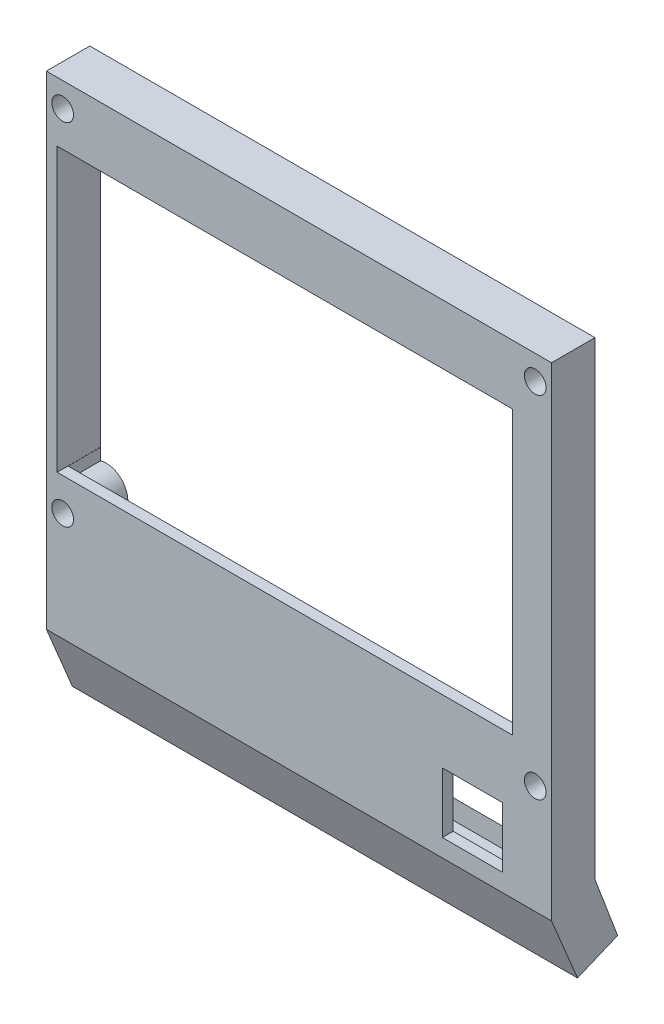
ISO-10303-21;
HEADER;
FILE_DESCRIPTION(('STEP AP214'),'2;1');
FILE_NAME('part.step','',(''),(''),'','','');
FILE_SCHEMA(('AUTOMOTIVE_DESIGN { 1 0 10303 214 1 1 1 1 }'));
ENDSEC;
DATA;
#1=APPLICATION_CONTEXT('core data for automotive mechanical design processes');
#2=APPLICATION_PROTOCOL_DEFINITION('international standard','automotive_design',2000,#1);
#3=PRODUCT_CONTEXT('',#1,'mechanical');
#4=PRODUCT('Part','Part','',(#3));
#5=PRODUCT_RELATED_PRODUCT_CATEGORY('part','',(#4));
#6=PRODUCT_DEFINITION_FORMATION('','',#4);
#7=PRODUCT_DEFINITION_CONTEXT('part definition',#1,'design');
#8=PRODUCT_DEFINITION('design','',#6,#7);
#9=PRODUCT_DEFINITION_SHAPE('','',#8);
#10=(LENGTH_UNIT() NAMED_UNIT(*) SI_UNIT(.MILLI.,.METRE.));
#11=(NAMED_UNIT(*) PLANE_ANGLE_UNIT() SI_UNIT($,.RADIAN.));
#12=(NAMED_UNIT(*) SI_UNIT($,.STERADIAN.) SOLID_ANGLE_UNIT());
#13=UNCERTAINTY_MEASURE_WITH_UNIT(LENGTH_MEASURE(1.E-05),#10,'distance_accuracy_value','');
#14=(GEOMETRIC_REPRESENTATION_CONTEXT(3) GLOBAL_UNCERTAINTY_ASSIGNED_CONTEXT((#13)) GLOBAL_UNIT_ASSIGNED_CONTEXT((#10,
#11,#12)) REPRESENTATION_CONTEXT('',''));
#15=CARTESIAN_POINT('',(0.,0.,0.));
#16=DIRECTION('',(0.,0.,1.));
#17=DIRECTION('',(1.,0.,0.));
#18=AXIS2_PLACEMENT_3D('',#15,#16,#17);
#19=CARTESIAN_POINT('',(39.3212525540889,33.528756997604,0.));
#20=DIRECTION('',(1.,0.,0.));
#21=DIRECTION('',(0.,1.,0.));
#22=AXIS2_PLACEMENT_3D('',#19,#20,#21);
#23=PLANE('',#22);
#24=DIRECTION('',(0.,1.,0.));
#25=VECTOR('',#24,1.);
#26=CARTESIAN_POINT('',(39.3212525540889,33.528756997604,6.));
#27=LINE('',#26,#25);
#28=CARTESIAN_POINT('',(39.3212525540889,-18.471243002396,6.));
#29=VERTEX_POINT('',#28);
#30=CARTESIAN_POINT('',(39.3212525540889,33.528756997604,6.));
#31=VERTEX_POINT('',#30);
#32=EDGE_CURVE('E321',#29,#31,#27,.T.);
#33=ORIENTED_EDGE('',*,*,#32,.F.);
#34=DIRECTION('',(0.,0.,1.));
#35=VECTOR('',#34,1.);
#36=CARTESIAN_POINT('',(39.3212525540889,-18.471243002396,0.));
#37=LINE('',#36,#35);
#38=CARTESIAN_POINT('',(39.3212525540889,-18.471243002396,8.));
#39=VERTEX_POINT('',#38);
#40=EDGE_CURVE('E423',#29,#39,#37,.T.);
#41=ORIENTED_EDGE('',*,*,#40,.T.);
#42=DIRECTION('',(0.,1.,0.));
#43=VECTOR('',#42,1.);
#44=CARTESIAN_POINT('',(39.3212525540889,33.528756997604,8.));
#45=LINE('',#44,#43);
#46=CARTESIAN_POINT('',(39.3212525540889,33.528756997604,8.));
#47=VERTEX_POINT('',#46);
#48=EDGE_CURVE('E414',#39,#47,#45,.T.);
#49=ORIENTED_EDGE('',*,*,#48,.T.);
#50=DIRECTION('',(0.,0.,1.));
#51=VECTOR('',#50,1.);
#52=CARTESIAN_POINT('',(39.3212525540889,33.528756997604,0.));
#53=LINE('',#52,#51);
#54=EDGE_CURVE('E421',#31,#47,#53,.T.);
#55=ORIENTED_EDGE('',*,*,#54,.F.);
#56=EDGE_LOOP('',(#33,#41,#49,#55));
#57=FACE_BOUND('',#56,.T.);
#58=ADVANCED_FACE('F40',(#57),#23,.F.);
#59=CARTESIAN_POINT('',(39.3212525540889,-18.471243002396,0.));
#60=DIRECTION('',(0.,-1.,0.));
#61=DIRECTION('',(1.,0.,0.));
#62=AXIS2_PLACEMENT_3D('',#59,#60,#61);
#63=PLANE('',#62);
#64=DIRECTION('',(0.,0.,1.));
#65=VECTOR('',#64,1.);
#66=CARTESIAN_POINT('',(-44.5,-18.471243002396,0.));
#67=LINE('',#66,#65);
#68=CARTESIAN_POINT('',(-44.5,-18.471243002396,0.));
#69=VERTEX_POINT('',#68);
#70=CARTESIAN_POINT('',(-44.5,-18.471243002396,6.));
#71=VERTEX_POINT('',#70);
#72=EDGE_CURVE('E333',#69,#71,#67,.T.);
#73=ORIENTED_EDGE('',*,*,#72,.F.);
#74=DIRECTION('',(1.,0.,0.));
#75=VECTOR('',#74,1.);
#76=CARTESIAN_POINT('',(39.3212525540889,-18.471243002396,0.));
#77=LINE('',#76,#75);
#78=CARTESIAN_POINT('',(-44.5211222996652,-18.471243002396,0.));
#79=VERTEX_POINT('',#78);
#80=EDGE_CURVE('E403',#79,#69,#77,.T.);
#81=ORIENTED_EDGE('',*,*,#80,.F.);
#82=DIRECTION('',(0.,0.,1.));
#83=VECTOR('',#82,1.);
#84=CARTESIAN_POINT('',(-44.5211222996652,-18.471243002396,0.));
#85=LINE('',#84,#83);
#86=CARTESIAN_POINT('',(-44.5211222996652,-18.471243002396,8.));
#87=VERTEX_POINT('',#86);
#88=EDGE_CURVE('E409',#79,#87,#85,.T.);
#89=ORIENTED_EDGE('',*,*,#88,.T.);
#90=DIRECTION('',(1.,0.,0.));
#91=VECTOR('',#90,1.);
#92=CARTESIAN_POINT('',(39.3212525540889,-18.471243002396,8.));
#93=LINE('',#92,#91);
#94=EDGE_CURVE('E411',#87,#39,#93,.T.);
#95=ORIENTED_EDGE('',*,*,#94,.T.);
#96=ORIENTED_EDGE('',*,*,#40,.F.);
#97=DIRECTION('',(1.,0.,0.));
#98=VECTOR('',#97,1.);
#99=CARTESIAN_POINT('',(39.3212525540889,-18.471243002396,6.));
#100=LINE('',#99,#98);
#101=EDGE_CURVE('E292',#71,#29,#100,.T.);
#102=ORIENTED_EDGE('',*,*,#101,.F.);
#103=EDGE_LOOP('',(#73,#81,#89,#95,#96,#102));
#104=FACE_BOUND('',#103,.T.);
#105=ADVANCED_FACE('F499',(#104),#63,.F.);
#106=CARTESIAN_POINT('',(26.4,-30.15,0.));
#107=DIRECTION('',(-1.,0.,0.));
#108=DIRECTION('',(0.,-1.,0.));
#109=AXIS2_PLACEMENT_3D('',#106,#107,#108);
#110=PLANE('',#109);
#111=DIRECTION('',(0.,-1.,0.));
#112=VECTOR('',#111,1.);
#113=CARTESIAN_POINT('',(26.4,-30.15,6.));
#114=LINE('',#113,#112);
#115=CARTESIAN_POINT('',(26.4,-30.15,6.));
#116=VERTEX_POINT('',#115);
#117=CARTESIAN_POINT('',(26.4,-41.25,6.));
#118=VERTEX_POINT('',#117);
#119=EDGE_CURVE('E315',#116,#118,#114,.T.);
#120=ORIENTED_EDGE('',*,*,#119,.F.);
#121=DIRECTION('',(0.,0.,1.));
#122=VECTOR('',#121,1.);
#123=CARTESIAN_POINT('',(26.4,-30.15,0.));
#124=LINE('',#123,#122);
#125=CARTESIAN_POINT('',(26.4,-30.15,8.));
#126=VERTEX_POINT('',#125);
#127=EDGE_CURVE('E377',#116,#126,#124,.T.);
#128=ORIENTED_EDGE('',*,*,#127,.T.);
#129=DIRECTION('',(0.,-1.,0.));
#130=VECTOR('',#129,1.);
#131=CARTESIAN_POINT('',(26.4,-30.15,8.));
#132=LINE('',#131,#130);
#133=CARTESIAN_POINT('',(26.4,-41.25,8.));
#134=VERTEX_POINT('',#133);
#135=EDGE_CURVE('E369',#126,#134,#132,.T.);
#136=ORIENTED_EDGE('',*,*,#135,.T.);
#137=DIRECTION('',(0.,0.,1.));
#138=VECTOR('',#137,1.);
#139=CARTESIAN_POINT('',(26.4,-41.25,0.));
#140=LINE('',#139,#138);
#141=EDGE_CURVE('E370',#118,#134,#140,.T.);
#142=ORIENTED_EDGE('',*,*,#141,.F.);
#143=EDGE_LOOP('',(#120,#128,#136,#142));
#144=FACE_BOUND('',#143,.T.);
#145=ADVANCED_FACE('F536',(#144),#110,.F.);
#146=CARTESIAN_POINT('',(37.5,-30.15,0.));
#147=DIRECTION('',(0.,1.,0.));
#148=DIRECTION('',(0.,0.,1.));
#149=AXIS2_PLACEMENT_3D('',#146,#147,#148);
#150=PLANE('',#149);
#151=DIRECTION('',(-1.,0.,0.));
#152=VECTOR('',#151,1.);
#153=CARTESIAN_POINT('',(37.5,-30.15,6.));
#154=LINE('',#153,#152);
#155=CARTESIAN_POINT('',(37.5,-30.15,6.));
#156=VERTEX_POINT('',#155);
#157=EDGE_CURVE('E297',#156,#116,#154,.T.);
#158=ORIENTED_EDGE('',*,*,#157,.F.);
#159=DIRECTION('',(0.,0.,1.));
#160=VECTOR('',#159,1.);
#161=CARTESIAN_POINT('',(37.5,-30.15,0.));
#162=LINE('',#161,#160);
#163=CARTESIAN_POINT('',(37.5,-30.15,8.));
#164=VERTEX_POINT('',#163);
#165=EDGE_CURVE('E375',#156,#164,#162,.T.);
#166=ORIENTED_EDGE('',*,*,#165,.T.);
#167=DIRECTION('',(-1.,0.,0.));
#168=VECTOR('',#167,1.);
#169=CARTESIAN_POINT('',(37.5,-30.15,8.));
#170=LINE('',#169,#168);
#171=EDGE_CURVE('E372',#164,#126,#170,.T.);
#172=ORIENTED_EDGE('',*,*,#171,.T.);
#173=ORIENTED_EDGE('',*,*,#127,.F.);
#174=EDGE_LOOP('',(#158,#166,#172,#173));
#175=FACE_BOUND('',#174,.T.);
#176=ADVANCED_FACE('F568',(#175),#150,.F.);
#177=CARTESIAN_POINT('',(37.4999999999999,-41.25,0.));
#178=DIRECTION('',(1.,0.,0.));
#179=DIRECTION('',(0.,1.,0.));
#180=AXIS2_PLACEMENT_3D('',#177,#178,#179);
#181=PLANE('',#180);
#182=DIRECTION('',(0.,1.,0.));
#183=VECTOR('',#182,1.);
#184=CARTESIAN_POINT('',(37.4999999999999,-41.25,6.));
#185=LINE('',#184,#183);
#186=CARTESIAN_POINT('',(37.4999999999999,-41.25,6.));
#187=VERTEX_POINT('',#186);
#188=EDGE_CURVE('E316',#187,#156,#185,.T.);
#189=ORIENTED_EDGE('',*,*,#188,.F.);
#190=DIRECTION('',(0.,0.,1.));
#191=VECTOR('',#190,1.);
#192=CARTESIAN_POINT('',(37.4999999999999,-41.25,0.));
#193=LINE('',#192,#191);
#194=CARTESIAN_POINT('',(37.4999999999999,-41.25,8.));
#195=VERTEX_POINT('',#194);
#196=EDGE_CURVE('E373',#187,#195,#193,.T.);
#197=ORIENTED_EDGE('',*,*,#196,.T.);
#198=DIRECTION('',(0.,1.,0.));
#199=VECTOR('',#198,1.);
#200=CARTESIAN_POINT('',(37.4999999999999,-41.25,8.));
#201=LINE('',#200,#199);
#202=EDGE_CURVE('E382',#195,#164,#201,.T.);
#203=ORIENTED_EDGE('',*,*,#202,.T.);
#204=ORIENTED_EDGE('',*,*,#165,.F.);
#205=EDGE_LOOP('',(#189,#197,#203,#204));
#206=FACE_BOUND('',#205,.T.);
#207=ADVANCED_FACE('F573',(#206),#181,.F.);
#208=CARTESIAN_POINT('',(37.4999999999999,-41.25,0.));
#209=DIRECTION('',(0.,-1.,0.));
#210=DIRECTION('',(0.,0.,-1.));
#211=AXIS2_PLACEMENT_3D('',#208,#209,#210);
#212=PLANE('',#211);
#213=DIRECTION('',(1.,0.,0.));
#214=VECTOR('',#213,1.);
#215=CARTESIAN_POINT('',(37.4999999999999,-41.25,6.));
#216=LINE('',#215,#214);
#217=EDGE_CURVE('E313',#118,#187,#216,.T.);
#218=ORIENTED_EDGE('',*,*,#217,.F.);
#219=ORIENTED_EDGE('',*,*,#141,.T.);
#220=DIRECTION('',(1.,0.,0.));
#221=VECTOR('',#220,1.);
#222=CARTESIAN_POINT('',(37.4999999999999,-41.25,8.));
#223=LINE('',#222,#221);
#224=EDGE_CURVE('E385',#134,#195,#223,.T.);
#225=ORIENTED_EDGE('',*,*,#224,.T.);
#226=ORIENTED_EDGE('',*,*,#196,.F.);
#227=EDGE_LOOP('',(#218,#219,#225,#226));
#228=FACE_BOUND('',#227,.T.);
#229=ADVANCED_FACE('F570',(#228),#212,.F.);
#230=CARTESIAN_POINT('',(46.5,-44.5,8.));
#231=DIRECTION('',(-1.,0.,0.));
#232=DIRECTION('',(0.,0.,1.));
#233=AXIS2_PLACEMENT_3D('',#230,#231,#232);
#234=PLANE('',#233);
#235=DIRECTION('',(0.,1.,0.));
#236=VECTOR('',#235,1.);
#237=CARTESIAN_POINT('',(46.5,-44.5,8.));
#238=LINE('',#237,#236);
#239=CARTESIAN_POINT('',(46.5,-44.5,8.));
#240=VERTEX_POINT('',#239);
#241=CARTESIAN_POINT('',(46.5,44.5,8.));
#242=VERTEX_POINT('',#241);
#243=EDGE_CURVE('E427',#240,#242,#238,.T.);
#244=ORIENTED_EDGE('',*,*,#243,.F.);
#245=DIRECTION('',(0.,-0.923061562841507,-0.38465224710717));
#246=VECTOR('',#245,1.);
#247=CARTESIAN_POINT('',(46.5,-44.5,8.));
#248=LINE('',#247,#246);
#249=CARTESIAN_POINT('',(46.5,-55.9929737336464,3.21072228489072));
#250=VERTEX_POINT('',#249);
#251=EDGE_CURVE('E251',#240,#250,#248,.T.);
#252=ORIENTED_EDGE('',*,*,#251,.T.);
#253=DIRECTION('',(0.,0.38465224710717,-0.923061562841507));
#254=VECTOR('',#253,1.);
#255=CARTESIAN_POINT('',(46.5,-55.9929737336464,3.21072228489072));
#256=LINE('',#255,#254);
#257=CARTESIAN_POINT('',(46.5,-52.9157557567891,-4.17377021784133));
#258=VERTEX_POINT('',#257);
#259=EDGE_CURVE('E265',#250,#258,#256,.T.);
#260=ORIENTED_EDGE('',*,*,#259,.T.);
#261=DIRECTION('',(0.,0.935246124206724,0.353998145696134));
#262=VECTOR('',#261,1.);
#263=CARTESIAN_POINT('',(46.5,-52.9157557567891,-4.17377021784133));
#264=LINE('',#263,#262);
#265=CARTESIAN_POINT('',(46.5,-41.8888550031443,0.));
#266=VERTEX_POINT('',#265);
#267=EDGE_CURVE('E256',#258,#266,#264,.T.);
#268=ORIENTED_EDGE('',*,*,#267,.T.);
#269=DIRECTION('',(0.,1.,0.));
#270=VECTOR('',#269,1.);
#271=CARTESIAN_POINT('',(46.5,-44.5,0.));
#272=LINE('',#271,#270);
#273=CARTESIAN_POINT('',(46.5,44.5,0.));
#274=VERTEX_POINT('',#273);
#275=EDGE_CURVE('E62',#266,#274,#272,.T.);
#276=ORIENTED_EDGE('',*,*,#275,.T.);
#277=DIRECTION('',(0.,0.,-1.));
#278=VECTOR('',#277,1.);
#279=CARTESIAN_POINT('',(46.5,44.5,8.));
#280=LINE('',#279,#278);
#281=EDGE_CURVE('E11',#242,#274,#280,.T.);
#282=ORIENTED_EDGE('',*,*,#281,.F.);
#283=EDGE_LOOP('',(#244,#252,#260,#268,#276,#282));
#284=FACE_BOUND('',#283,.T.);
#285=ADVANCED_FACE('F42',(#284),#234,.F.);
#286=CARTESIAN_POINT('',(-46.5,44.5,8.));
#287=DIRECTION('',(0.,-1.,0.));
#288=DIRECTION('',(0.,0.,-1.));
#289=AXIS2_PLACEMENT_3D('',#286,#287,#288);
#290=PLANE('',#289);
#291=DIRECTION('',(-1.,0.,0.));
#292=VECTOR('',#291,1.);
#293=CARTESIAN_POINT('',(-46.5,44.5,0.));
#294=LINE('',#293,#292);
#295=CARTESIAN_POINT('',(-46.5,44.5,0.));
#296=VERTEX_POINT('',#295);
#297=EDGE_CURVE('E438',#274,#296,#294,.T.);
#298=ORIENTED_EDGE('',*,*,#297,.T.);
#299=DIRECTION('',(0.,0.,-1.));
#300=VECTOR('',#299,1.);
#301=CARTESIAN_POINT('',(-46.5,44.5,8.));
#302=LINE('',#301,#300);
#303=CARTESIAN_POINT('',(-46.5,44.5,8.));
#304=VERTEX_POINT('',#303);
#305=EDGE_CURVE('E48',#304,#296,#302,.T.);
#306=ORIENTED_EDGE('',*,*,#305,.F.);
#307=DIRECTION('',(-1.,0.,0.));
#308=VECTOR('',#307,1.);
#309=CARTESIAN_POINT('',(-46.5,44.5,8.));
#310=LINE('',#309,#308);
#311=EDGE_CURVE('E430',#242,#304,#310,.T.);
#312=ORIENTED_EDGE('',*,*,#311,.F.);
#313=ORIENTED_EDGE('',*,*,#281,.T.);
#314=EDGE_LOOP('',(#298,#306,#312,#313));
#315=FACE_BOUND('',#314,.T.);
#316=ADVANCED_FACE('F451',(#315),#290,.F.);
#317=CARTESIAN_POINT('',(-46.5,-44.5,8.));
#318=DIRECTION('',(1.,0.,0.));
#319=DIRECTION('',(0.,0.,-1.));
#320=AXIS2_PLACEMENT_3D('',#317,#318,#319);
#321=PLANE('',#320);
#322=DIRECTION('',(0.,-1.,0.));
#323=VECTOR('',#322,1.);
#324=CARTESIAN_POINT('',(-46.5,-44.5,0.));
#325=LINE('',#324,#323);
#326=CARTESIAN_POINT('',(-46.5,-41.8888550031443,0.));
#327=VERTEX_POINT('',#326);
#328=EDGE_CURVE('E431',#296,#327,#325,.T.);
#329=ORIENTED_EDGE('',*,*,#328,.T.);
#330=DIRECTION('',(0.,0.935246124206724,0.353998145696134));
#331=VECTOR('',#330,1.);
#332=CARTESIAN_POINT('',(-46.5,-52.9157557567891,-4.17377021784133));
#333=LINE('',#332,#331);
#334=CARTESIAN_POINT('',(-46.5,-52.9157557567891,-4.17377021784133));
#335=VERTEX_POINT('',#334);
#336=EDGE_CURVE('E259',#335,#327,#333,.T.);
#337=ORIENTED_EDGE('',*,*,#336,.F.);
#338=DIRECTION('',(0.,0.38465224710717,-0.923061562841507));
#339=VECTOR('',#338,1.);
#340=CARTESIAN_POINT('',(-46.5,-55.9929737336464,3.21072228489072));
#341=LINE('',#340,#339);
#342=CARTESIAN_POINT('',(-46.5,-55.9929737336464,3.21072228489072));
#343=VERTEX_POINT('',#342);
#344=EDGE_CURVE('E255',#343,#335,#341,.T.);
#345=ORIENTED_EDGE('',*,*,#344,.F.);
#346=DIRECTION('',(0.,-0.923061562841507,-0.38465224710717));
#347=VECTOR('',#346,1.);
#348=CARTESIAN_POINT('',(-46.5,-44.5,8.));
#349=LINE('',#348,#347);
#350=CARTESIAN_POINT('',(-46.5,-44.5,8.));
#351=VERTEX_POINT('',#350);
#352=EDGE_CURVE('E252',#351,#343,#349,.T.);
#353=ORIENTED_EDGE('',*,*,#352,.F.);
#354=DIRECTION('',(0.,-1.,0.));
#355=VECTOR('',#354,1.);
#356=CARTESIAN_POINT('',(-46.5,-44.5,8.));
#357=LINE('',#356,#355);
#358=EDGE_CURVE('E433',#304,#351,#357,.T.);
#359=ORIENTED_EDGE('',*,*,#358,.F.);
#360=ORIENTED_EDGE('',*,*,#305,.T.);
#361=EDGE_LOOP('',(#329,#337,#345,#353,#359,#360));
#362=FACE_BOUND('',#361,.T.);
#363=ADVANCED_FACE('F444',(#362),#321,.F.);
#364=CARTESIAN_POINT('',(0.,0.,8.));
#365=DIRECTION('',(0.,0.,-1.));
#366=DIRECTION('',(-1.,0.,0.));
#367=AXIS2_PLACEMENT_3D('',#364,#365,#366);
#368=PLANE('',#367);
#369=CARTESIAN_POINT('',(43.5,40.,8.));
#370=DIRECTION('',(0.,0.,1.));
#371=DIRECTION('',(1.,0.,0.));
#372=AXIS2_PLACEMENT_3D('',#369,#370,#371);
#373=CIRCLE('',#372,2.);
#374=CARTESIAN_POINT('',(45.5,40.,8.));
#375=VERTEX_POINT('',#374);
#376=EDGE_CURVE('E362',#375,#375,#373,.T.);
#377=ORIENTED_EDGE('',*,*,#376,.F.);
#378=EDGE_LOOP('',(#377));
#379=FACE_BOUND('',#378,.T.);
#380=ORIENTED_EDGE('',*,*,#224,.F.);
#381=ORIENTED_EDGE('',*,*,#135,.F.);
#382=ORIENTED_EDGE('',*,*,#171,.F.);
#383=ORIENTED_EDGE('',*,*,#202,.F.);
#384=EDGE_LOOP('',(#380,#381,#382,#383));
#385=FACE_BOUND('',#384,.T.);
#386=CARTESIAN_POINT('',(-43.5,40.,8.));
#387=DIRECTION('',(0.,0.,1.));
#388=DIRECTION('',(1.,0.,0.));
#389=AXIS2_PLACEMENT_3D('',#386,#387,#388);
#390=CIRCLE('',#389,2.);
#391=CARTESIAN_POINT('',(-41.5,40.,8.));
#392=VERTEX_POINT('',#391);
#393=EDGE_CURVE('E379',#392,#392,#390,.T.);
#394=ORIENTED_EDGE('',*,*,#393,.F.);
#395=EDGE_LOOP('',(#394));
#396=FACE_BOUND('',#395,.T.);
#397=CARTESIAN_POINT('',(-43.5,-24.5,8.));
#398=DIRECTION('',(0.,0.,1.));
#399=DIRECTION('',(1.,0.,0.));
#400=AXIS2_PLACEMENT_3D('',#397,#398,#399);
#401=CIRCLE('',#400,2.);
#402=CARTESIAN_POINT('',(-41.5,-24.5,8.));
#403=VERTEX_POINT('',#402);
#404=EDGE_CURVE('E395',#403,#403,#401,.T.);
#405=ORIENTED_EDGE('',*,*,#404,.F.);
#406=EDGE_LOOP('',(#405));
#407=FACE_BOUND('',#406,.T.);
#408=CARTESIAN_POINT('',(43.5,-24.5,8.));
#409=DIRECTION('',(0.,0.,1.));
#410=DIRECTION('',(1.,0.,0.));
#411=AXIS2_PLACEMENT_3D('',#408,#409,#410);
#412=CIRCLE('',#411,2.);
#413=CARTESIAN_POINT('',(45.5,-24.5,8.));
#414=VERTEX_POINT('',#413);
#415=EDGE_CURVE('E356',#414,#414,#412,.T.);
#416=ORIENTED_EDGE('',*,*,#415,.F.);
#417=EDGE_LOOP('',(#416));
#418=FACE_BOUND('',#417,.T.);
#419=ORIENTED_EDGE('',*,*,#94,.F.);
#420=DIRECTION('',(0.,-1.,0.));
#421=VECTOR('',#420,1.);
#422=CARTESIAN_POINT('',(-44.5211222996652,-18.471243002396,8.));
#423=LINE('',#422,#421);
#424=CARTESIAN_POINT('',(-44.5211222996652,33.528756997604,8.));
#425=VERTEX_POINT('',#424);
#426=EDGE_CURVE('E365',#425,#87,#423,.T.);
#427=ORIENTED_EDGE('',*,*,#426,.F.);
#428=DIRECTION('',(-1.,0.,0.));
#429=VECTOR('',#428,1.);
#430=CARTESIAN_POINT('',(-44.5211222996652,33.528756997604,8.));
#431=LINE('',#430,#429);
#432=EDGE_CURVE('E404',#47,#425,#431,.T.);
#433=ORIENTED_EDGE('',*,*,#432,.F.);
#434=ORIENTED_EDGE('',*,*,#48,.F.);
#435=EDGE_LOOP('',(#419,#427,#433,#434));
#436=FACE_BOUND('',#435,.T.);
#437=ORIENTED_EDGE('',*,*,#243,.T.);
#438=ORIENTED_EDGE('',*,*,#311,.T.);
#439=ORIENTED_EDGE('',*,*,#358,.T.);
#440=DIRECTION('',(1.,0.,0.));
#441=VECTOR('',#440,1.);
#442=CARTESIAN_POINT('',(-46.5,-44.5,8.));
#443=LINE('',#442,#441);
#444=EDGE_CURVE('E435',#351,#240,#443,.T.);
#445=ORIENTED_EDGE('',*,*,#444,.T.);
#446=EDGE_LOOP('',(#437,#438,#439,#445));
#447=FACE_BOUND('',#446,.T.);
#448=ADVANCED_FACE('F517',(#379,#385,#396,#407,#418,#436,#447),#368,.F.);
#449=CARTESIAN_POINT('',(0.,0.,0.));
#450=DIRECTION('',(0.,0.,-1.));
#451=DIRECTION('',(-1.,0.,0.));
#452=AXIS2_PLACEMENT_3D('',#449,#450,#451);
#453=PLANE('',#452);
#454=DIRECTION('',(1.,0.,0.));
#455=VECTOR('',#454,1.);
#456=CARTESIAN_POINT('',(-46.5,-41.8888550031443,0.));
#457=LINE('',#456,#455);
#458=CARTESIAN_POINT('',(-44.5,-41.8888550031443,0.));
#459=VERTEX_POINT('',#458);
#460=EDGE_CURVE('E55',#327,#459,#457,.T.);
#461=ORIENTED_EDGE('',*,*,#460,.F.);
#462=ORIENTED_EDGE('',*,*,#328,.F.);
#463=ORIENTED_EDGE('',*,*,#297,.F.);
#464=ORIENTED_EDGE('',*,*,#275,.F.);
#465=CARTESIAN_POINT('',(44.5,-41.8888550031443,0.));
#466=VERTEX_POINT('',#465);
#467=EDGE_CURVE('E272',#466,#266,#457,.T.);
#468=ORIENTED_EDGE('',*,*,#467,.F.);
#469=DIRECTION('',(0.,1.,0.));
#470=VECTOR('',#469,1.);
#471=CARTESIAN_POINT('',(44.5,0.,0.));
#472=LINE('',#471,#470);
#473=CARTESIAN_POINT('',(44.5,-28.3729833462074,0.));
#474=VERTEX_POINT('',#473);
#475=EDGE_CURVE('E229',#466,#474,#472,.T.);
#476=ORIENTED_EDGE('',*,*,#475,.T.);
#477=CARTESIAN_POINT('',(43.5,-24.5,0.));
#478=DIRECTION('',(0.,0.,-1.));
#479=DIRECTION('',(-1.,0.,0.));
#480=AXIS2_PLACEMENT_3D('',#477,#478,#479);
#481=CIRCLE('',#480,4.);
#482=CARTESIAN_POINT('',(44.5,-20.6270166537926,0.));
#483=VERTEX_POINT('',#482);
#484=EDGE_CURVE('E277',#483,#474,#481,.F.);
#485=ORIENTED_EDGE('',*,*,#484,.F.);
#486=CARTESIAN_POINT('',(44.5,36.1270166537926,0.));
#487=VERTEX_POINT('',#486);
#488=EDGE_CURVE('E233',#483,#487,#472,.T.);
#489=ORIENTED_EDGE('',*,*,#488,.T.);
#490=CARTESIAN_POINT('',(43.5,40.,0.));
#491=DIRECTION('',(0.,0.,-1.));
#492=DIRECTION('',(-1.,0.,0.));
#493=AXIS2_PLACEMENT_3D('',#490,#491,#492);
#494=CIRCLE('',#493,4.);
#495=CARTESIAN_POINT('',(40.3775010008008,42.5,0.));
#496=VERTEX_POINT('',#495);
#497=EDGE_CURVE('E293',#496,#487,#494,.F.);
#498=ORIENTED_EDGE('',*,*,#497,.F.);
#499=DIRECTION('',(-1.,0.,0.));
#500=VECTOR('',#499,1.);
#501=CARTESIAN_POINT('',(0.,42.5,0.));
#502=LINE('',#501,#500);
#503=CARTESIAN_POINT('',(-40.3775010008008,42.5,0.));
#504=VERTEX_POINT('',#503);
#505=EDGE_CURVE('E310',#496,#504,#502,.T.);
#506=ORIENTED_EDGE('',*,*,#505,.T.);
#507=CARTESIAN_POINT('',(-43.5,40.,0.));
#508=DIRECTION('',(0.,0.,-1.));
#509=DIRECTION('',(-1.,0.,0.));
#510=AXIS2_PLACEMENT_3D('',#507,#508,#509);
#511=CIRCLE('',#510,4.);
#512=CARTESIAN_POINT('',(-44.5,36.1270166537926,0.));
#513=VERTEX_POINT('',#512);
#514=EDGE_CURVE('E298',#513,#504,#511,.F.);
#515=ORIENTED_EDGE('',*,*,#514,.F.);
#516=DIRECTION('',(0.,-1.,0.));
#517=VECTOR('',#516,1.);
#518=CARTESIAN_POINT('',(-44.5,0.,0.));
#519=LINE('',#518,#517);
#520=CARTESIAN_POINT('',(-44.5,33.528756997604,0.));
#521=VERTEX_POINT('',#520);
#522=EDGE_CURVE('E309',#513,#521,#519,.T.);
#523=ORIENTED_EDGE('',*,*,#522,.T.);
#524=DIRECTION('',(-1.,0.,0.));
#525=VECTOR('',#524,1.);
#526=CARTESIAN_POINT('',(-44.5211222996652,33.528756997604,0.));
#527=LINE('',#526,#525);
#528=CARTESIAN_POINT('',(-44.5211222996652,33.528756997604,0.));
#529=VERTEX_POINT('',#528);
#530=EDGE_CURVE('E407',#521,#529,#527,.T.);
#531=ORIENTED_EDGE('',*,*,#530,.T.);
#532=DIRECTION('',(0.,-1.,0.));
#533=VECTOR('',#532,1.);
#534=CARTESIAN_POINT('',(-44.5211222996652,-18.471243002396,0.));
#535=LINE('',#534,#533);
#536=EDGE_CURVE('E400',#529,#79,#535,.T.);
#537=ORIENTED_EDGE('',*,*,#536,.T.);
#538=ORIENTED_EDGE('',*,*,#80,.T.);
#539=CARTESIAN_POINT('',(-44.5,-20.6270166537926,0.));
#540=VERTEX_POINT('',#539);
#541=EDGE_CURVE('E308',#69,#540,#519,.T.);
#542=ORIENTED_EDGE('',*,*,#541,.T.);
#543=CARTESIAN_POINT('',(-43.5,-24.5,0.));
#544=DIRECTION('',(0.,0.,-1.));
#545=DIRECTION('',(-1.,0.,0.));
#546=AXIS2_PLACEMENT_3D('',#543,#544,#545);
#547=CIRCLE('',#546,4.);
#548=CARTESIAN_POINT('',(-44.5,-28.3729833462074,0.));
#549=VERTEX_POINT('',#548);
#550=EDGE_CURVE('E302',#549,#540,#547,.F.);
#551=ORIENTED_EDGE('',*,*,#550,.F.);
#552=EDGE_CURVE('E306',#549,#459,#519,.T.);
#553=ORIENTED_EDGE('',*,*,#552,.T.);
#554=EDGE_LOOP('',(#461,#462,#463,#464,#468,#476,#485,#489,#498,#506,#515,#523,#531,#537,#538,
#542,#551,#553));
#555=FACE_BOUND('',#554,.T.);
#556=CARTESIAN_POINT('',(43.5,40.,0.));
#557=DIRECTION('',(0.,0.,1.));
#558=DIRECTION('',(1.,0.,0.));
#559=AXIS2_PLACEMENT_3D('',#556,#557,#558);
#560=CIRCLE('',#559,2.);
#561=CARTESIAN_POINT('',(45.5,40.,0.));
#562=VERTEX_POINT('',#561);
#563=EDGE_CURVE('E366',#562,#562,#560,.T.);
#564=ORIENTED_EDGE('',*,*,#563,.T.);
#565=EDGE_LOOP('',(#564));
#566=FACE_BOUND('',#565,.T.);
#567=CARTESIAN_POINT('',(-43.5,40.,0.));
#568=DIRECTION('',(0.,0.,1.));
#569=DIRECTION('',(1.,0.,0.));
#570=AXIS2_PLACEMENT_3D('',#567,#568,#569);
#571=CIRCLE('',#570,2.);
#572=CARTESIAN_POINT('',(-41.5,40.,0.));
#573=VERTEX_POINT('',#572);
#574=EDGE_CURVE('E392',#573,#573,#571,.T.);
#575=ORIENTED_EDGE('',*,*,#574,.T.);
#576=EDGE_LOOP('',(#575));
#577=FACE_BOUND('',#576,.T.);
#578=CARTESIAN_POINT('',(-43.5,-24.5,0.));
#579=DIRECTION('',(0.,0.,1.));
#580=DIRECTION('',(1.,0.,0.));
#581=AXIS2_PLACEMENT_3D('',#578,#579,#580);
#582=CIRCLE('',#581,2.);
#583=CARTESIAN_POINT('',(-41.5,-24.5,0.));
#584=VERTEX_POINT('',#583);
#585=EDGE_CURVE('E359',#584,#584,#582,.T.);
#586=ORIENTED_EDGE('',*,*,#585,.T.);
#587=EDGE_LOOP('',(#586));
#588=FACE_BOUND('',#587,.T.);
#589=CARTESIAN_POINT('',(43.5,-24.5,0.));
#590=DIRECTION('',(0.,0.,1.));
#591=DIRECTION('',(1.,0.,0.));
#592=AXIS2_PLACEMENT_3D('',#589,#590,#591);
#593=CIRCLE('',#592,2.);
#594=CARTESIAN_POINT('',(45.5,-24.5,0.));
#595=VERTEX_POINT('',#594);
#596=EDGE_CURVE('E355',#595,#595,#593,.T.);
#597=ORIENTED_EDGE('',*,*,#596,.T.);
#598=EDGE_LOOP('',(#597));
#599=FACE_BOUND('',#598,.T.);
#600=ADVANCED_FACE('F448',(#555,#566,#577,#588,#599),#453,.T.);
#601=CARTESIAN_POINT('',(-44.5211222996652,-18.471243002396,0.));
#602=DIRECTION('',(-1.,0.,0.));
#603=DIRECTION('',(0.,0.,1.));
#604=AXIS2_PLACEMENT_3D('',#601,#602,#603);
#605=PLANE('',#604);
#606=ORIENTED_EDGE('',*,*,#426,.T.);
#607=ORIENTED_EDGE('',*,*,#88,.F.);
#608=ORIENTED_EDGE('',*,*,#536,.F.);
#609=DIRECTION('',(0.,0.,1.));
#610=VECTOR('',#609,1.);
#611=CARTESIAN_POINT('',(-44.5211222996652,33.528756997604,0.));
#612=LINE('',#611,#610);
#613=EDGE_CURVE('E419',#529,#425,#612,.T.);
#614=ORIENTED_EDGE('',*,*,#613,.T.);
#615=EDGE_LOOP('',(#606,#607,#608,#614));
#616=FACE_BOUND('',#615,.T.);
#617=ADVANCED_FACE('F493',(#616),#605,.F.);
#618=CARTESIAN_POINT('',(-44.5211222996652,33.528756997604,0.));
#619=DIRECTION('',(0.,1.,0.));
#620=DIRECTION('',(-1.,0.,0.));
#621=AXIS2_PLACEMENT_3D('',#618,#619,#620);
#622=PLANE('',#621);
#623=ORIENTED_EDGE('',*,*,#530,.F.);
#624=DIRECTION('',(0.,0.,1.));
#625=VECTOR('',#624,1.);
#626=CARTESIAN_POINT('',(-44.5,33.528756997604,8.));
#627=LINE('',#626,#625);
#628=CARTESIAN_POINT('',(-44.5,33.528756997604,6.));
#629=VERTEX_POINT('',#628);
#630=EDGE_CURVE('E336',#521,#629,#627,.T.);
#631=ORIENTED_EDGE('',*,*,#630,.T.);
#632=DIRECTION('',(-1.,0.,0.));
#633=VECTOR('',#632,1.);
#634=CARTESIAN_POINT('',(-44.5211222996652,33.528756997604,6.));
#635=LINE('',#634,#633);
#636=EDGE_CURVE('E323',#31,#629,#635,.T.);
#637=ORIENTED_EDGE('',*,*,#636,.F.);
#638=ORIENTED_EDGE('',*,*,#54,.T.);
#639=ORIENTED_EDGE('',*,*,#432,.T.);
#640=ORIENTED_EDGE('',*,*,#613,.F.);
#641=EDGE_LOOP('',(#623,#631,#637,#638,#639,#640));
#642=FACE_BOUND('',#641,.T.);
#643=ADVANCED_FACE('F487',(#642),#622,.F.);
#644=CARTESIAN_POINT('',(43.5,-24.5,0.));
#645=DIRECTION('',(0.,0.,1.));
#646=DIRECTION('',(1.,0.,0.));
#647=AXIS2_PLACEMENT_3D('',#644,#645,#646);
#648=CYLINDRICAL_SURFACE('',#647,2.);
#649=ORIENTED_EDGE('',*,*,#596,.F.);
#650=EDGE_LOOP('',(#649));
#651=FACE_BOUND('',#650,.T.);
#652=ORIENTED_EDGE('',*,*,#415,.T.);
#653=EDGE_LOOP('',(#652));
#654=FACE_BOUND('',#653,.T.);
#655=ADVANCED_FACE('F545',(#651,#654),#648,.F.);
#656=CARTESIAN_POINT('',(-43.5,-24.5,0.));
#657=DIRECTION('',(0.,0.,1.));
#658=DIRECTION('',(1.,0.,0.));
#659=AXIS2_PLACEMENT_3D('',#656,#657,#658);
#660=CYLINDRICAL_SURFACE('',#659,2.);
#661=ORIENTED_EDGE('',*,*,#585,.F.);
#662=EDGE_LOOP('',(#661));
#663=FACE_BOUND('',#662,.T.);
#664=ORIENTED_EDGE('',*,*,#404,.T.);
#665=EDGE_LOOP('',(#664));
#666=FACE_BOUND('',#665,.T.);
#667=ADVANCED_FACE('F549',(#663,#666),#660,.F.);
#668=CARTESIAN_POINT('',(-43.5,40.,0.));
#669=DIRECTION('',(0.,0.,1.));
#670=DIRECTION('',(1.,0.,0.));
#671=AXIS2_PLACEMENT_3D('',#668,#669,#670);
#672=CYLINDRICAL_SURFACE('',#671,2.);
#673=ORIENTED_EDGE('',*,*,#574,.F.);
#674=EDGE_LOOP('',(#673));
#675=FACE_BOUND('',#674,.T.);
#676=ORIENTED_EDGE('',*,*,#393,.T.);
#677=EDGE_LOOP('',(#676));
#678=FACE_BOUND('',#677,.T.);
#679=ADVANCED_FACE('F555',(#675,#678),#672,.F.);
#680=CARTESIAN_POINT('',(43.5,40.,0.));
#681=DIRECTION('',(0.,0.,1.));
#682=DIRECTION('',(1.,0.,0.));
#683=AXIS2_PLACEMENT_3D('',#680,#681,#682);
#684=CYLINDRICAL_SURFACE('',#683,2.);
#685=ORIENTED_EDGE('',*,*,#563,.F.);
#686=EDGE_LOOP('',(#685));
#687=FACE_BOUND('',#686,.T.);
#688=ORIENTED_EDGE('',*,*,#376,.T.);
#689=EDGE_LOOP('',(#688));
#690=FACE_BOUND('',#689,.T.);
#691=ADVANCED_FACE('F562',(#687,#690),#684,.F.);
#692=CARTESIAN_POINT('',(-44.5,-44.5,8.));
#693=DIRECTION('',(1.,0.,0.));
#694=DIRECTION('',(0.,0.,-1.));
#695=AXIS2_PLACEMENT_3D('',#692,#693,#694);
#696=PLANE('',#695);
#697=ORIENTED_EDGE('',*,*,#541,.F.);
#698=ORIENTED_EDGE('',*,*,#72,.T.);
#699=DIRECTION('',(0.,-1.,0.));
#700=VECTOR('',#699,1.);
#701=CARTESIAN_POINT('',(-44.5,0.,6.));
#702=LINE('',#701,#700);
#703=CARTESIAN_POINT('',(-44.5,-20.6270166537926,6.));
#704=VERTEX_POINT('',#703);
#705=EDGE_CURVE('E285',#71,#704,#702,.T.);
#706=ORIENTED_EDGE('',*,*,#705,.T.);
#707=DIRECTION('',(0.,0.,1.));
#708=VECTOR('',#707,1.);
#709=CARTESIAN_POINT('',(-44.5,-20.6270166537926,0.));
#710=LINE('',#709,#708);
#711=EDGE_CURVE('E345',#540,#704,#710,.T.);
#712=ORIENTED_EDGE('',*,*,#711,.F.);
#713=EDGE_LOOP('',(#697,#698,#706,#712));
#714=FACE_BOUND('',#713,.T.);
#715=ADVANCED_FACE('F504',(#714),#696,.T.);
#716=CARTESIAN_POINT('',(44.5,-44.5,8.));
#717=DIRECTION('',(-1.,0.,0.));
#718=DIRECTION('',(0.,0.,1.));
#719=AXIS2_PLACEMENT_3D('',#716,#717,#718);
#720=PLANE('',#719);
#721=CARTESIAN_POINT('',(44.5,-45.5,0.));
#722=VERTEX_POINT('',#721);
#723=EDGE_CURVE('E221',#722,#466,#472,.T.);
#724=ORIENTED_EDGE('',*,*,#723,.F.);
#725=DIRECTION('',(0.,0.,-1.));
#726=VECTOR('',#725,1.);
#727=CARTESIAN_POINT('',(44.5,-45.5,6.));
#728=LINE('',#727,#726);
#729=CARTESIAN_POINT('',(44.5,-45.5,6.));
#730=VERTEX_POINT('',#729);
#731=EDGE_CURVE('E226',#730,#722,#728,.T.);
#732=ORIENTED_EDGE('',*,*,#731,.F.);
#733=DIRECTION('',(0.,1.,0.));
#734=VECTOR('',#733,1.);
#735=CARTESIAN_POINT('',(44.5,0.,6.));
#736=LINE('',#735,#734);
#737=CARTESIAN_POINT('',(44.5,-28.3729833462074,6.));
#738=VERTEX_POINT('',#737);
#739=EDGE_CURVE('E278',#730,#738,#736,.T.);
#740=ORIENTED_EDGE('',*,*,#739,.T.);
#741=DIRECTION('',(0.,0.,1.));
#742=VECTOR('',#741,1.);
#743=CARTESIAN_POINT('',(44.5,-28.3729833462074,0.));
#744=LINE('',#743,#742);
#745=EDGE_CURVE('E341',#474,#738,#744,.T.);
#746=ORIENTED_EDGE('',*,*,#745,.F.);
#747=ORIENTED_EDGE('',*,*,#475,.F.);
#748=EDGE_LOOP('',(#724,#732,#740,#746,#747));
#749=FACE_BOUND('',#748,.T.);
#750=ADVANCED_FACE('F223',(#749),#720,.T.);
#751=DIRECTION('',(0.,0.,1.));
#752=VECTOR('',#751,1.);
#753=CARTESIAN_POINT('',(-44.5,36.1270166537926,0.));
#754=LINE('',#753,#752);
#755=CARTESIAN_POINT('',(-44.5,36.1270166537926,6.));
#756=VERTEX_POINT('',#755);
#757=EDGE_CURVE('E347',#513,#756,#754,.T.);
#758=ORIENTED_EDGE('',*,*,#757,.T.);
#759=EDGE_CURVE('E288',#756,#629,#702,.T.);
#760=ORIENTED_EDGE('',*,*,#759,.T.);
#761=ORIENTED_EDGE('',*,*,#630,.F.);
#762=ORIENTED_EDGE('',*,*,#522,.F.);
#763=EDGE_LOOP('',(#758,#760,#761,#762));
#764=FACE_BOUND('',#763,.T.);
#765=ADVANCED_FACE('F601',(#764),#696,.T.);
#766=ORIENTED_EDGE('',*,*,#488,.F.);
#767=DIRECTION('',(0.,0.,1.));
#768=VECTOR('',#767,1.);
#769=CARTESIAN_POINT('',(44.5,-20.6270166537926,0.));
#770=LINE('',#769,#768);
#771=CARTESIAN_POINT('',(44.5,-20.6270166537926,6.));
#772=VERTEX_POINT('',#771);
#773=EDGE_CURVE('E339',#483,#772,#770,.T.);
#774=ORIENTED_EDGE('',*,*,#773,.T.);
#775=CARTESIAN_POINT('',(44.5,36.1270166537926,6.));
#776=VERTEX_POINT('',#775);
#777=EDGE_CURVE('E281',#772,#776,#736,.T.);
#778=ORIENTED_EDGE('',*,*,#777,.T.);
#779=DIRECTION('',(0.,0.,1.));
#780=VECTOR('',#779,1.);
#781=CARTESIAN_POINT('',(44.5,36.1270166537926,0.));
#782=LINE('',#781,#780);
#783=EDGE_CURVE('E351',#487,#776,#782,.T.);
#784=ORIENTED_EDGE('',*,*,#783,.F.);
#785=EDGE_LOOP('',(#766,#774,#778,#784));
#786=FACE_BOUND('',#785,.T.);
#787=ADVANCED_FACE('F468',(#786),#720,.T.);
#788=CARTESIAN_POINT('',(-46.5,42.5,8.));
#789=DIRECTION('',(0.,-1.,0.));
#790=DIRECTION('',(0.,0.,-1.));
#791=AXIS2_PLACEMENT_3D('',#788,#789,#790);
#792=PLANE('',#791);
#793=DIRECTION('',(0.,0.,1.));
#794=VECTOR('',#793,1.);
#795=CARTESIAN_POINT('',(40.3775010008008,42.5,0.));
#796=LINE('',#795,#794);
#797=CARTESIAN_POINT('',(40.3775010008008,42.5,6.));
#798=VERTEX_POINT('',#797);
#799=EDGE_CURVE('E353',#496,#798,#796,.T.);
#800=ORIENTED_EDGE('',*,*,#799,.T.);
#801=DIRECTION('',(-1.,0.,0.));
#802=VECTOR('',#801,1.);
#803=CARTESIAN_POINT('',(0.,42.5,6.));
#804=LINE('',#803,#802);
#805=CARTESIAN_POINT('',(-40.3775010008008,42.5,6.));
#806=VERTEX_POINT('',#805);
#807=EDGE_CURVE('E280',#798,#806,#804,.T.);
#808=ORIENTED_EDGE('',*,*,#807,.T.);
#809=DIRECTION('',(0.,0.,1.));
#810=VECTOR('',#809,1.);
#811=CARTESIAN_POINT('',(-40.3775010008008,42.5,0.));
#812=LINE('',#811,#810);
#813=EDGE_CURVE('E349',#504,#806,#812,.T.);
#814=ORIENTED_EDGE('',*,*,#813,.F.);
#815=ORIENTED_EDGE('',*,*,#505,.F.);
#816=EDGE_LOOP('',(#800,#808,#814,#815));
#817=FACE_BOUND('',#816,.T.);
#818=ADVANCED_FACE('F477',(#817),#792,.T.);
#819=DIRECTION('',(0.,0.,1.));
#820=VECTOR('',#819,1.);
#821=CARTESIAN_POINT('',(-44.5,-28.3729833462074,0.));
#822=LINE('',#821,#820);
#823=CARTESIAN_POINT('',(-44.5,-28.3729833462074,6.));
#824=VERTEX_POINT('',#823);
#825=EDGE_CURVE('E343',#549,#824,#822,.T.);
#826=ORIENTED_EDGE('',*,*,#825,.T.);
#827=CARTESIAN_POINT('',(-44.5,-45.5,6.));
#828=VERTEX_POINT('',#827);
#829=EDGE_CURVE('E284',#824,#828,#702,.T.);
#830=ORIENTED_EDGE('',*,*,#829,.T.);
#831=DIRECTION('',(0.,0.,1.));
#832=VECTOR('',#831,1.);
#833=CARTESIAN_POINT('',(-44.5,-45.5,0.));
#834=LINE('',#833,#832);
#835=CARTESIAN_POINT('',(-44.5,-45.5,0.));
#836=VERTEX_POINT('',#835);
#837=EDGE_CURVE('E242',#836,#828,#834,.T.);
#838=ORIENTED_EDGE('',*,*,#837,.F.);
#839=DIRECTION('',(0.,-1.,0.));
#840=VECTOR('',#839,1.);
#841=CARTESIAN_POINT('',(-44.5,-44.5,0.));
#842=LINE('',#841,#840);
#843=EDGE_CURVE('E238',#459,#836,#842,.T.);
#844=ORIENTED_EDGE('',*,*,#843,.F.);
#845=ORIENTED_EDGE('',*,*,#552,.F.);
#846=EDGE_LOOP('',(#826,#830,#838,#844,#845));
#847=FACE_BOUND('',#846,.T.);
#848=ADVANCED_FACE('F604',(#847),#696,.T.);
#849=CARTESIAN_POINT('',(0.,0.,6.));
#850=DIRECTION('',(0.,0.,-1.));
#851=DIRECTION('',(-1.,0.,0.));
#852=AXIS2_PLACEMENT_3D('',#849,#850,#851);
#853=PLANE('',#852);
#854=ORIENTED_EDGE('',*,*,#217,.T.);
#855=ORIENTED_EDGE('',*,*,#188,.T.);
#856=ORIENTED_EDGE('',*,*,#157,.T.);
#857=ORIENTED_EDGE('',*,*,#119,.T.);
#858=EDGE_LOOP('',(#854,#855,#856,#857));
#859=FACE_BOUND('',#858,.T.);
#860=ORIENTED_EDGE('',*,*,#807,.F.);
#861=CARTESIAN_POINT('',(43.5,40.,6.));
#862=DIRECTION('',(0.,0.,-1.));
#863=DIRECTION('',(-1.,0.,0.));
#864=AXIS2_PLACEMENT_3D('',#861,#862,#863);
#865=CIRCLE('',#864,4.);
#866=EDGE_CURVE('E289',#798,#776,#865,.F.);
#867=ORIENTED_EDGE('',*,*,#866,.T.);
#868=ORIENTED_EDGE('',*,*,#777,.F.);
#869=CARTESIAN_POINT('',(43.5,-24.5,6.));
#870=DIRECTION('',(0.,0.,-1.));
#871=DIRECTION('',(-1.,0.,0.));
#872=AXIS2_PLACEMENT_3D('',#869,#870,#871);
#873=CIRCLE('',#872,4.);
#874=EDGE_CURVE('E303',#772,#738,#873,.F.);
#875=ORIENTED_EDGE('',*,*,#874,.T.);
#876=ORIENTED_EDGE('',*,*,#739,.F.);
#877=DIRECTION('',(1.,0.,0.));
#878=VECTOR('',#877,1.);
#879=CARTESIAN_POINT('',(-44.5,-45.5,6.));
#880=LINE('',#879,#878);
#881=EDGE_CURVE('E246',#828,#730,#880,.T.);
#882=ORIENTED_EDGE('',*,*,#881,.F.);
#883=ORIENTED_EDGE('',*,*,#829,.F.);
#884=CARTESIAN_POINT('',(-43.5,-24.5,6.));
#885=DIRECTION('',(0.,0.,-1.));
#886=DIRECTION('',(-1.,0.,0.));
#887=AXIS2_PLACEMENT_3D('',#884,#885,#886);
#888=CIRCLE('',#887,4.);
#889=EDGE_CURVE('E299',#824,#704,#888,.F.);
#890=ORIENTED_EDGE('',*,*,#889,.T.);
#891=ORIENTED_EDGE('',*,*,#705,.F.);
#892=ORIENTED_EDGE('',*,*,#101,.T.);
#893=ORIENTED_EDGE('',*,*,#32,.T.);
#894=ORIENTED_EDGE('',*,*,#636,.T.);
#895=ORIENTED_EDGE('',*,*,#759,.F.);
#896=CARTESIAN_POINT('',(-43.5,40.,6.));
#897=DIRECTION('',(0.,0.,-1.));
#898=DIRECTION('',(-1.,0.,0.));
#899=AXIS2_PLACEMENT_3D('',#896,#897,#898);
#900=CIRCLE('',#899,4.);
#901=EDGE_CURVE('E294',#756,#806,#900,.F.);
#902=ORIENTED_EDGE('',*,*,#901,.T.);
#903=EDGE_LOOP('',(#860,#867,#868,#875,#876,#882,#883,#890,#891,#892,#893,#894,#895,#902));
#904=FACE_BOUND('',#903,.T.);
#905=ADVANCED_FACE('F597',(#859,#904),#853,.T.);
#906=CARTESIAN_POINT('',(43.5,-24.5,0.));
#907=DIRECTION('',(0.,0.,1.));
#908=DIRECTION('',(1.,0.,0.));
#909=AXIS2_PLACEMENT_3D('',#906,#907,#908);
#910=CYLINDRICAL_SURFACE('',#909,4.);
#911=ORIENTED_EDGE('',*,*,#745,.T.);
#912=ORIENTED_EDGE('',*,*,#874,.F.);
#913=ORIENTED_EDGE('',*,*,#773,.F.);
#914=ORIENTED_EDGE('',*,*,#484,.T.);
#915=EDGE_LOOP('',(#911,#912,#913,#914));
#916=FACE_BOUND('',#915,.T.);
#917=ADVANCED_FACE('F463',(#916),#910,.T.);
#918=CARTESIAN_POINT('',(-43.5,-24.5,0.));
#919=DIRECTION('',(0.,0.,1.));
#920=DIRECTION('',(1.,0.,0.));
#921=AXIS2_PLACEMENT_3D('',#918,#919,#920);
#922=CYLINDRICAL_SURFACE('',#921,4.);
#923=ORIENTED_EDGE('',*,*,#711,.T.);
#924=ORIENTED_EDGE('',*,*,#889,.F.);
#925=ORIENTED_EDGE('',*,*,#825,.F.);
#926=ORIENTED_EDGE('',*,*,#550,.T.);
#927=EDGE_LOOP('',(#923,#924,#925,#926));
#928=FACE_BOUND('',#927,.T.);
#929=ADVANCED_FACE('F507',(#928),#922,.T.);
#930=CARTESIAN_POINT('',(-43.5,40.,0.));
#931=DIRECTION('',(0.,0.,1.));
#932=DIRECTION('',(1.,0.,0.));
#933=AXIS2_PLACEMENT_3D('',#930,#931,#932);
#934=CYLINDRICAL_SURFACE('',#933,4.);
#935=ORIENTED_EDGE('',*,*,#813,.T.);
#936=ORIENTED_EDGE('',*,*,#901,.F.);
#937=ORIENTED_EDGE('',*,*,#757,.F.);
#938=ORIENTED_EDGE('',*,*,#514,.T.);
#939=EDGE_LOOP('',(#935,#936,#937,#938));
#940=FACE_BOUND('',#939,.T.);
#941=ADVANCED_FACE('F480',(#940),#934,.T.);
#942=CARTESIAN_POINT('',(43.5,40.,0.));
#943=DIRECTION('',(0.,0.,1.));
#944=DIRECTION('',(1.,0.,0.));
#945=AXIS2_PLACEMENT_3D('',#942,#943,#944);
#946=CYLINDRICAL_SURFACE('',#945,4.);
#947=ORIENTED_EDGE('',*,*,#497,.T.);
#948=ORIENTED_EDGE('',*,*,#783,.T.);
#949=ORIENTED_EDGE('',*,*,#866,.F.);
#950=ORIENTED_EDGE('',*,*,#799,.F.);
#951=EDGE_LOOP('',(#947,#948,#949,#950));
#952=FACE_BOUND('',#951,.T.);
#953=ADVANCED_FACE('F473',(#952),#946,.T.);
#954=CARTESIAN_POINT('',(-46.5,-44.5,0.));
#955=DIRECTION('',(0.,0.,1.));
#956=DIRECTION('',(0.,-1.,0.));
#957=AXIS2_PLACEMENT_3D('',#954,#955,#956);
#958=PLANE('',#957);
#959=ORIENTED_EDGE('',*,*,#843,.T.);
#960=DIRECTION('',(-1.,0.,0.));
#961=VECTOR('',#960,1.);
#962=CARTESIAN_POINT('',(44.5,-45.5,0.));
#963=LINE('',#962,#961);
#964=EDGE_CURVE('E236',#722,#836,#963,.T.);
#965=ORIENTED_EDGE('',*,*,#964,.F.);
#966=ORIENTED_EDGE('',*,*,#723,.T.);
#967=EDGE_CURVE('E271',#459,#466,#457,.T.);
#968=ORIENTED_EDGE('',*,*,#967,.F.);
#969=EDGE_LOOP('',(#959,#965,#966,#968));
#970=FACE_BOUND('',#969,.T.);
#971=ADVANCED_FACE('F237',(#970),#958,.T.);
#972=CARTESIAN_POINT('',(-46.5,-52.9157557567891,-4.17377021784133));
#973=DIRECTION('',(0.,0.353998145696134,-0.935246124206724));
#974=DIRECTION('',(0.,0.935246124206724,0.353998145696134));
#975=AXIS2_PLACEMENT_3D('',#972,#973,#974);
#976=PLANE('',#975);
#977=ORIENTED_EDGE('',*,*,#267,.F.);
#978=DIRECTION('',(1.,0.,0.));
#979=VECTOR('',#978,1.);
#980=CARTESIAN_POINT('',(-46.5,-52.9157557567891,-4.17377021784133));
#981=LINE('',#980,#979);
#982=EDGE_CURVE('E273',#335,#258,#981,.T.);
#983=ORIENTED_EDGE('',*,*,#982,.F.);
#984=ORIENTED_EDGE('',*,*,#336,.T.);
#985=ORIENTED_EDGE('',*,*,#460,.T.);
#986=ORIENTED_EDGE('',*,*,#967,.T.);
#987=ORIENTED_EDGE('',*,*,#467,.T.);
#988=EDGE_LOOP('',(#977,#983,#984,#985,#986,#987));
#989=FACE_BOUND('',#988,.T.);
#990=ADVANCED_FACE('F458',(#989),#976,.T.);
#991=CARTESIAN_POINT('',(-46.5,-55.9929737336464,3.21072228489072));
#992=DIRECTION('',(0.,-0.923061562841507,-0.38465224710717));
#993=DIRECTION('',(0.,0.38465224710717,-0.923061562841507));
#994=AXIS2_PLACEMENT_3D('',#991,#992,#993);
#995=PLANE('',#994);
#996=ORIENTED_EDGE('',*,*,#259,.F.);
#997=DIRECTION('',(1.,0.,0.));
#998=VECTOR('',#997,1.);
#999=CARTESIAN_POINT('',(-46.5,-55.9929737336464,3.21072228489072));
#1000=LINE('',#999,#998);
#1001=EDGE_CURVE('E262',#343,#250,#1000,.T.);
#1002=ORIENTED_EDGE('',*,*,#1001,.F.);
#1003=ORIENTED_EDGE('',*,*,#344,.T.);
#1004=ORIENTED_EDGE('',*,*,#982,.T.);
#1005=EDGE_LOOP('',(#996,#1002,#1003,#1004));
#1006=FACE_BOUND('',#1005,.T.);
#1007=ADVANCED_FACE('F512',(#1006),#995,.T.);
#1008=CARTESIAN_POINT('',(-46.5,-44.5,8.));
#1009=DIRECTION('',(0.,-0.38465224710717,0.923061562841507));
#1010=DIRECTION('',(0.,-0.923061562841507,-0.38465224710717));
#1011=AXIS2_PLACEMENT_3D('',#1008,#1009,#1010);
#1012=PLANE('',#1011);
#1013=ORIENTED_EDGE('',*,*,#251,.F.);
#1014=ORIENTED_EDGE('',*,*,#444,.F.);
#1015=ORIENTED_EDGE('',*,*,#352,.T.);
#1016=ORIENTED_EDGE('',*,*,#1001,.T.);
#1017=EDGE_LOOP('',(#1013,#1014,#1015,#1016));
#1018=FACE_BOUND('',#1017,.T.);
#1019=ADVANCED_FACE('F514',(#1018),#1012,.T.);
#1020=CARTESIAN_POINT('',(0.,-45.5,0.));
#1021=DIRECTION('',(0.,1.,0.));
#1022=DIRECTION('',(0.,0.,1.));
#1023=AXIS2_PLACEMENT_3D('',#1020,#1021,#1022);
#1024=PLANE('',#1023);
#1025=ORIENTED_EDGE('',*,*,#731,.T.);
#1026=ORIENTED_EDGE('',*,*,#964,.T.);
#1027=ORIENTED_EDGE('',*,*,#837,.T.);
#1028=ORIENTED_EDGE('',*,*,#881,.T.);
#1029=EDGE_LOOP('',(#1025,#1026,#1027,#1028));
#1030=FACE_BOUND('',#1029,.T.);
#1031=ADVANCED_FACE('F244',(#1030),#1024,.T.);
#1032=CLOSED_SHELL('',(#58,#105,#145,#176,#207,#229,#285,#316,#363,#448,#600,#617,#643,#655,
#667,#679,#691,#715,#750,#765,#787,#818,#848,#905,#917,#929,#941,#953,#971,#990,#1007,#1019,#1031));
#1033=MANIFOLD_SOLID_BREP('B2',#1032);
#1034=ADVANCED_BREP_SHAPE_REPRESENTATION('',(#18,#1033),#14);
#1035=SHAPE_DEFINITION_REPRESENTATION(#9,#1034);
ENDSEC;
END-ISO-10303-21;
